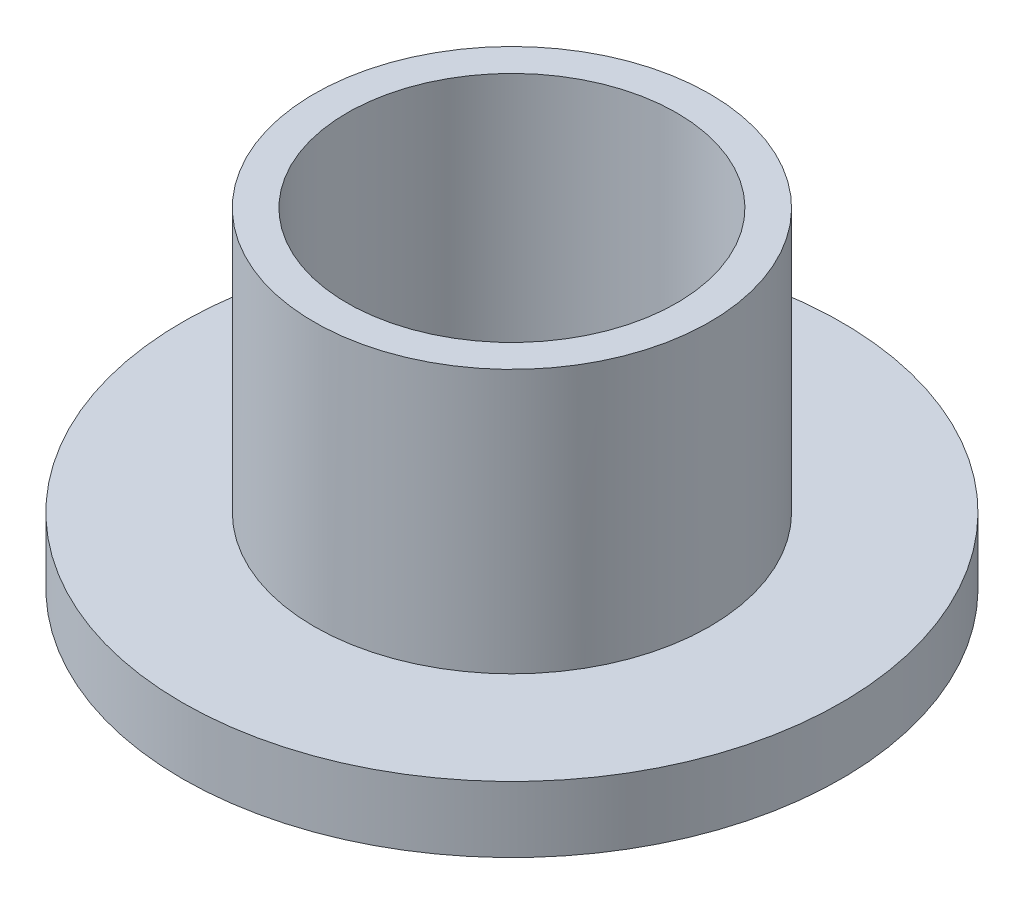
ISO-10303-21;
HEADER;
FILE_DESCRIPTION(('STEP AP214'),'2;1');
FILE_NAME('part.step','',(''),(''),'','','');
FILE_SCHEMA(('AUTOMOTIVE_DESIGN { 1 0 10303 214 1 1 1 1 }'));
ENDSEC;
DATA;
#1=APPLICATION_CONTEXT('core data for automotive mechanical design processes');
#2=APPLICATION_PROTOCOL_DEFINITION('international standard','automotive_design',2000,#1);
#3=PRODUCT_CONTEXT('',#1,'mechanical');
#4=PRODUCT('Part','Part','',(#3));
#5=PRODUCT_RELATED_PRODUCT_CATEGORY('part','',(#4));
#6=PRODUCT_DEFINITION_FORMATION('','',#4);
#7=PRODUCT_DEFINITION_CONTEXT('part definition',#1,'design');
#8=PRODUCT_DEFINITION('design','',#6,#7);
#9=PRODUCT_DEFINITION_SHAPE('','',#8);
#10=(LENGTH_UNIT() NAMED_UNIT(*) SI_UNIT(.MILLI.,.METRE.));
#11=(NAMED_UNIT(*) PLANE_ANGLE_UNIT() SI_UNIT($,.RADIAN.));
#12=(NAMED_UNIT(*) SI_UNIT($,.STERADIAN.) SOLID_ANGLE_UNIT());
#13=UNCERTAINTY_MEASURE_WITH_UNIT(LENGTH_MEASURE(1.E-05),#10,'distance_accuracy_value','');
#14=(GEOMETRIC_REPRESENTATION_CONTEXT(3) GLOBAL_UNCERTAINTY_ASSIGNED_CONTEXT((#13)) GLOBAL_UNIT_ASSIGNED_CONTEXT((#10,
#11,#12)) REPRESENTATION_CONTEXT('',''));
#15=CARTESIAN_POINT('',(0.,0.,0.));
#16=DIRECTION('',(0.,0.,1.));
#17=DIRECTION('',(1.,0.,0.));
#18=AXIS2_PLACEMENT_3D('',#15,#16,#17);
#19=CARTESIAN_POINT('',(0.,2.,0.));
#20=DIRECTION('',(0.,-1.,0.));
#21=DIRECTION('',(0.,0.,-1.));
#22=AXIS2_PLACEMENT_3D('',#19,#20,#21);
#23=CYLINDRICAL_SURFACE('',#22,10.);
#24=CARTESIAN_POINT('',(0.,2.,0.));
#25=DIRECTION('',(0.,1.,0.));
#26=DIRECTION('',(0.,0.,1.));
#27=AXIS2_PLACEMENT_3D('',#24,#25,#26);
#28=CIRCLE('',#27,10.);
#29=CARTESIAN_POINT('',(0.,2.,10.));
#30=VERTEX_POINT('',#29);
#31=EDGE_CURVE('E45',#30,#30,#28,.T.);
#32=ORIENTED_EDGE('',*,*,#31,.F.);
#33=EDGE_LOOP('',(#32));
#34=FACE_BOUND('',#33,.T.);
#35=CARTESIAN_POINT('',(0.,0.,0.));
#36=DIRECTION('',(0.,1.,0.));
#37=DIRECTION('',(0.,0.,1.));
#38=AXIS2_PLACEMENT_3D('',#35,#36,#37);
#39=CIRCLE('',#38,10.);
#40=CARTESIAN_POINT('',(0.,0.,10.));
#41=VERTEX_POINT('',#40);
#42=EDGE_CURVE('E40',#41,#41,#39,.T.);
#43=ORIENTED_EDGE('',*,*,#42,.T.);
#44=EDGE_LOOP('',(#43));
#45=FACE_BOUND('',#44,.T.);
#46=ADVANCED_FACE('F37',(#34,#45),#23,.T.);
#47=CARTESIAN_POINT('',(0.,2.,0.));
#48=DIRECTION('',(0.,1.,0.));
#49=DIRECTION('',(0.,0.,1.));
#50=AXIS2_PLACEMENT_3D('',#47,#48,#49);
#51=PLANE('',#50);
#52=CARTESIAN_POINT('',(0.,2.,0.));
#53=DIRECTION('',(0.,1.,0.));
#54=DIRECTION('',(0.,0.,1.));
#55=AXIS2_PLACEMENT_3D('',#52,#53,#54);
#56=CIRCLE('',#55,6.);
#57=CARTESIAN_POINT('',(0.,2.,6.));
#58=VERTEX_POINT('',#57);
#59=EDGE_CURVE('E10',#58,#58,#56,.T.);
#60=ORIENTED_EDGE('',*,*,#59,.F.);
#61=EDGE_LOOP('',(#60));
#62=FACE_BOUND('',#61,.T.);
#63=ORIENTED_EDGE('',*,*,#31,.T.);
#64=EDGE_LOOP('',(#63));
#65=FACE_BOUND('',#64,.T.);
#66=ADVANCED_FACE('F71',(#62,#65),#51,.T.);
#67=CARTESIAN_POINT('',(0.,0.,0.));
#68=DIRECTION('',(0.,1.,0.));
#69=DIRECTION('',(0.,0.,1.));
#70=AXIS2_PLACEMENT_3D('',#67,#68,#69);
#71=PLANE('',#70);
#72=CARTESIAN_POINT('',(0.,0.,0.));
#73=DIRECTION('',(0.,-1.,0.));
#74=DIRECTION('',(0.,0.,-1.));
#75=AXIS2_PLACEMENT_3D('',#72,#73,#74);
#76=CIRCLE('',#75,5.);
#77=CARTESIAN_POINT('',(0.,0.,-5.));
#78=VERTEX_POINT('',#77);
#79=EDGE_CURVE('E60',#78,#78,#76,.T.);
#80=ORIENTED_EDGE('',*,*,#79,.F.);
#81=EDGE_LOOP('',(#80));
#82=FACE_BOUND('',#81,.T.);
#83=ORIENTED_EDGE('',*,*,#42,.F.);
#84=EDGE_LOOP('',(#83));
#85=FACE_BOUND('',#84,.T.);
#86=ADVANCED_FACE('F67',(#82,#85),#71,.F.);
#87=CARTESIAN_POINT('',(0.,10.,0.));
#88=DIRECTION('',(0.,-1.,0.));
#89=DIRECTION('',(0.,0.,-1.));
#90=AXIS2_PLACEMENT_3D('',#87,#88,#89);
#91=CYLINDRICAL_SURFACE('',#90,6.);
#92=ORIENTED_EDGE('',*,*,#59,.T.);
#93=EDGE_LOOP('',(#92));
#94=FACE_BOUND('',#93,.T.);
#95=CARTESIAN_POINT('',(0.,10.,0.));
#96=DIRECTION('',(0.,-1.,0.));
#97=DIRECTION('',(0.,0.,-1.));
#98=AXIS2_PLACEMENT_3D('',#95,#96,#97);
#99=CIRCLE('',#98,6.);
#100=CARTESIAN_POINT('',(0.,10.,-6.));
#101=VERTEX_POINT('',#100);
#102=EDGE_CURVE('E52',#101,#101,#99,.T.);
#103=ORIENTED_EDGE('',*,*,#102,.T.);
#104=EDGE_LOOP('',(#103));
#105=FACE_BOUND('',#104,.T.);
#106=ADVANCED_FACE('F70',(#94,#105),#91,.T.);
#107=CARTESIAN_POINT('',(0.,10.,0.));
#108=DIRECTION('',(0.,-1.,0.));
#109=DIRECTION('',(0.,0.,-1.));
#110=AXIS2_PLACEMENT_3D('',#107,#108,#109);
#111=PLANE('',#110);
#112=CARTESIAN_POINT('',(0.,10.,0.));
#113=DIRECTION('',(0.,-1.,0.));
#114=DIRECTION('',(0.,0.,-1.));
#115=AXIS2_PLACEMENT_3D('',#112,#113,#114);
#116=CIRCLE('',#115,5.);
#117=CARTESIAN_POINT('',(0.,10.,-5.));
#118=VERTEX_POINT('',#117);
#119=EDGE_CURVE('E56',#118,#118,#116,.T.);
#120=ORIENTED_EDGE('',*,*,#119,.T.);
#121=EDGE_LOOP('',(#120));
#122=FACE_BOUND('',#121,.T.);
#123=ORIENTED_EDGE('',*,*,#102,.F.);
#124=EDGE_LOOP('',(#123));
#125=FACE_BOUND('',#124,.T.);
#126=ADVANCED_FACE('F90',(#122,#125),#111,.F.);
#127=CARTESIAN_POINT('',(0.,10.,0.));
#128=DIRECTION('',(0.,-1.,0.));
#129=DIRECTION('',(0.,0.,-1.));
#130=AXIS2_PLACEMENT_3D('',#127,#128,#129);
#131=CYLINDRICAL_SURFACE('',#130,5.);
#132=ORIENTED_EDGE('',*,*,#119,.F.);
#133=EDGE_LOOP('',(#132));
#134=FACE_BOUND('',#133,.T.);
#135=ORIENTED_EDGE('',*,*,#79,.T.);
#136=EDGE_LOOP('',(#135));
#137=FACE_BOUND('',#136,.T.);
#138=ADVANCED_FACE('F65',(#134,#137),#131,.F.);
#139=CLOSED_SHELL('',(#46,#66,#86,#106,#126,#138));
#140=MANIFOLD_SOLID_BREP('B2',#139);
#141=ADVANCED_BREP_SHAPE_REPRESENTATION('',(#18,#140),#14);
#142=SHAPE_DEFINITION_REPRESENTATION(#9,#141);
ENDSEC;
END-ISO-10303-21;
